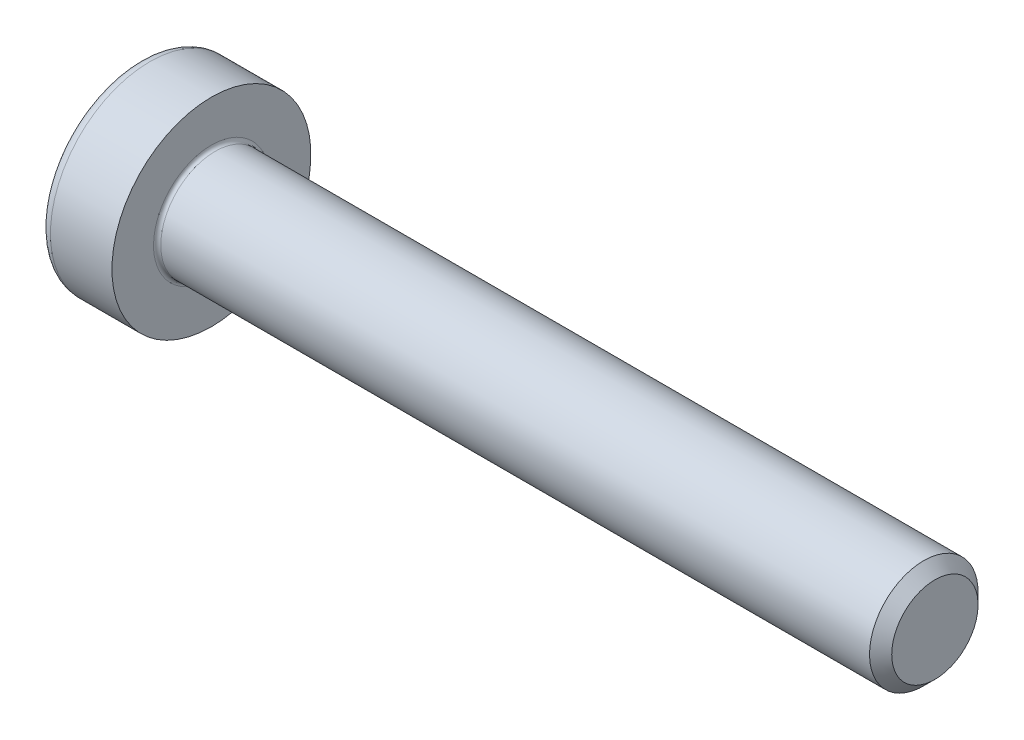
ISO-10303-21;
HEADER;
FILE_DESCRIPTION(('STEP AP214'),'2;1');
FILE_NAME('part.step','',(''),(''),'','','');
FILE_SCHEMA(('AUTOMOTIVE_DESIGN { 1 0 10303 214 1 1 1 1 }'));
ENDSEC;
DATA;
#1=APPLICATION_CONTEXT('core data for automotive mechanical design processes');
#2=APPLICATION_PROTOCOL_DEFINITION('international standard','automotive_design',2000,#1);
#3=PRODUCT_CONTEXT('',#1,'mechanical');
#4=PRODUCT('Part','Part','',(#3));
#5=PRODUCT_RELATED_PRODUCT_CATEGORY('part','',(#4));
#6=PRODUCT_DEFINITION_FORMATION('','',#4);
#7=PRODUCT_DEFINITION_CONTEXT('part definition',#1,'design');
#8=PRODUCT_DEFINITION('design','',#6,#7);
#9=PRODUCT_DEFINITION_SHAPE('','',#8);
#10=(LENGTH_UNIT() NAMED_UNIT(*) SI_UNIT(.MILLI.,.METRE.));
#11=(NAMED_UNIT(*) PLANE_ANGLE_UNIT() SI_UNIT($,.RADIAN.));
#12=(NAMED_UNIT(*) SI_UNIT($,.STERADIAN.) SOLID_ANGLE_UNIT());
#13=UNCERTAINTY_MEASURE_WITH_UNIT(LENGTH_MEASURE(1.E-05),#10,'distance_accuracy_value','');
#14=(GEOMETRIC_REPRESENTATION_CONTEXT(3) GLOBAL_UNCERTAINTY_ASSIGNED_CONTEXT((#13)) GLOBAL_UNIT_ASSIGNED_CONTEXT((#10,
#11,#12)) REPRESENTATION_CONTEXT('',''));
#15=CARTESIAN_POINT('',(0.,0.,0.));
#16=DIRECTION('',(0.,0.,1.));
#17=DIRECTION('',(1.,0.,0.));
#18=AXIS2_PLACEMENT_3D('',#15,#16,#17);
#19=CARTESIAN_POINT('',(-0.503999999864391,0.,0.));
#20=DIRECTION('',(-1.,0.,0.));
#21=DIRECTION('',(0.,0.,1.));
#22=AXIS2_PLACEMENT_3D('',#19,#20,#21);
#23=CONICAL_SURFACE('',#22,1.1616287414995,1.04719755106306);
#24=CARTESIAN_POINT('',(0.166666666729043,0.,-2.55795384873636E-10));
#25=VERTEX_POINT('',#24);
#26=VERTEX_LOOP('',#25);
#27=FACE_BOUND('',#26,.T.);
#28=CARTESIAN_POINT('',(-0.499999999935222,1.00000000000491,-0.577350269177087));
#29=CARTESIAN_POINT('',(-0.485347772489934,0.956056056225039,-0.602721316953868));
#30=CARTESIAN_POINT('',(-0.472022338470447,0.911732788945331,-0.628311367251723));
#31=CARTESIAN_POINT('',(-0.448763193610896,0.82231882665936,-0.67993454244871));
#32=CARTESIAN_POINT('',(-0.438837710076516,0.777226543457182,-0.705968584293173));
#33=CARTESIAN_POINT('',(-0.423387979375422,0.687600783115176,-0.757714041152466));
#34=CARTESIAN_POINT('',(-0.417760893698934,0.643081092184438,-0.783417496695743));
#35=CARTESIAN_POINT('',(-0.41104458396388,0.553832339757466,-0.834945287934423));
#36=CARTESIAN_POINT('',(-0.409949796885829,0.509103602433593,-0.860769436468825));
#37=CARTESIAN_POINT('',(-0.41223314497789,0.425532755130289,-0.909019087655762));
#38=CARTESIAN_POINT('',(-0.415050642509833,0.386678104664362,-0.931451830561545));
#39=CARTESIAN_POINT('',(-0.423978650263971,0.309221929106313,-0.97617117437039));
#40=CARTESIAN_POINT('',(-0.430092207291208,0.270620671714464,-0.99845762071663));
#41=CARTESIAN_POINT('',(-0.445374916580759,0.193004929129963,-1.04326909059114));
#42=CARTESIAN_POINT('',(-0.454608821023536,0.154000262301474,-1.06578844548422));
#43=CARTESIAN_POINT('',(-0.475565880340147,0.0765725149931354,-1.11049137623544));
#44=CARTESIAN_POINT('',(-0.487284114299871,0.0381484433395347,-1.13267552434801));
#45=CARTESIAN_POINT('',(-0.499999999927232,-1.64991277628039E-12,-1.1547005383802));
#46=B_SPLINE_CURVE_WITH_KNOTS('',3,(#28,#29,#30,#31,#32,#33,#34,#35,#36,#37,#38,#39,#40,#41,#42,
#43,#44,#45),.UNSPECIFIED.,.F.,.F.,(4,2,2,2,2,2,2,2,4),(0.,0.158508005788835,0.317396908534535,
0.472353803104991,0.627120444484892,0.761853891348244,0.896712096925861,1.03456081127119,
1.1721389867824),.UNSPECIFIED.);
#47=CARTESIAN_POINT('',(-0.499999999930649,1.00000000000519,-0.577350269194378));
#48=VERTEX_POINT('',#47);
#49=CARTESIAN_POINT('',(-0.499999999988176,-3.42089561929613E-13,-1.1547005384041));
#50=VERTEX_POINT('',#49);
#51=EDGE_CURVE('E59',#48,#50,#46,.T.);
#52=ORIENTED_EDGE('',*,*,#51,.T.);
#53=CARTESIAN_POINT('',(-0.499999999927126,1.33568071440912E-12,-1.15470053838002));
#54=CARTESIAN_POINT('',(-0.4853477724855,-0.0439439437814064,-1.1293294906078));
#55=CARTESIAN_POINT('',(-0.472022338467729,-0.0882672110619572,-1.10373944031201));
#56=CARTESIAN_POINT('',(-0.448763193609842,-0.177681173347852,-1.05211626511694));
#57=CARTESIAN_POINT('',(-0.438837710075409,-0.222773456549108,-1.02608222327232));
#58=CARTESIAN_POINT('',(-0.42338797937458,-0.312399216889828,-0.974336766413279));
#59=CARTESIAN_POINT('',(-0.417760893698407,-0.356918907820192,-0.948633310870395));
#60=CARTESIAN_POINT('',(-0.411044583963776,-0.446167660246257,-0.897105519632368));
#61=CARTESIAN_POINT('',(-0.409949796885831,-0.490896397569596,-0.871281371098226));
#62=CARTESIAN_POINT('',(-0.41223314497805,-0.574467244872945,-0.823031719911232));
#63=CARTESIAN_POINT('',(-0.415050642510144,-0.613321895339444,-0.80059897700513));
#64=CARTESIAN_POINT('',(-0.423978650264666,-0.690778070898627,-0.755879633195637));
#65=CARTESIAN_POINT('',(-0.430092207292135,-0.729379328291038,-0.73359318684907));
#66=CARTESIAN_POINT('',(-0.445374916582215,-0.806995070876625,-0.688781716973929));
#67=CARTESIAN_POINT('',(-0.454608821025286,-0.845999737705639,-0.666262362080546));
#68=CARTESIAN_POINT('',(-0.47556588034252,-0.923427485014991,-0.621559431328746));
#69=CARTESIAN_POINT('',(-0.487284114302569,-0.96185155666908,-0.599375283215896));
#70=CARTESIAN_POINT('',(-0.499999999930263,-1.00000000001075,-0.57735026918342));
#71=B_SPLINE_CURVE_WITH_KNOTS('',3,(#53,#54,#55,#56,#57,#58,#59,#60,#61,#62,#63,#64,#65,#66,#67,
#68,#69,#70),.UNSPECIFIED.,.F.,.F.,(4,2,2,2,2,2,2,2,4),(0.,0.158508005786671,0.317396908530352,
0.472353803099115,0.627120444477262,0.761853891342593,0.896712096922235,1.03456081126952,
1.17213898678261),.UNSPECIFIED.);
#72=CARTESIAN_POINT('',(-0.499999999928679,-1.00000000000599,-0.577350269186164));
#73=VERTEX_POINT('',#72);
#74=EDGE_CURVE('E229',#50,#73,#71,.T.);
#75=ORIENTED_EDGE('',*,*,#74,.T.);
#76=CARTESIAN_POINT('',(-0.499999999936326,-0.999999999990861,-0.577350269202308));
#77=CARTESIAN_POINT('',(-0.485347772490685,-0.999999999996718,-0.526608173658066));
#78=CARTESIAN_POINT('',(-0.472022338471013,-0.99999999999912,-0.47542807306613));
#79=CARTESIAN_POINT('',(-0.448763193611243,-1.00000000000088,-0.372181722674816));
#80=CARTESIAN_POINT('',(-0.43883771007683,-1.00000000000023,-0.320113638984764));
#81=CARTESIAN_POINT('',(-0.423387979375641,-0.999999999999772,-0.216622725265286));
#82=CARTESIAN_POINT('',(-0.417760893699089,-0.999999999999939,-0.16521581417893));
#83=CARTESIAN_POINT('',(-0.411044583963929,-1.00000000000006,-0.0621602317016219));
#84=CARTESIAN_POINT('',(-0.409949796885834,-1.00000000000002,-0.0105119346326718));
#85=CARTESIAN_POINT('',(-0.412233144977849,-0.999999999999987,0.0859873677423551));
#86=CARTESIAN_POINT('',(-0.415050642509862,-0.999999999999997,0.130852853554934));
#87=CARTESIAN_POINT('',(-0.423978650264289,-1.,0.220291541174657));
#88=CARTESIAN_POINT('',(-0.430092207291745,-1.,0.264864433868154));
#89=CARTESIAN_POINT('',(-0.445374916581862,-0.999999999999999,0.354487373619237));
#90=CARTESIAN_POINT('',(-0.454608821024991,-1.,0.39952608340644));
#91=CARTESIAN_POINT('',(-0.475565880342394,-1.,0.48893194491092));
#92=CARTESIAN_POINT('',(-0.487284114302557,-1.,0.533300241137063));
#93=CARTESIAN_POINT('',(-0.499999999930384,-1.,0.577350269202451));
#94=B_SPLINE_CURVE_WITH_KNOTS('',3,(#76,#77,#78,#79,#80,#81,#82,#83,#84,#85,#86,#87,#88,#89,#90,
#91,#92,#93),.UNSPECIFIED.,.F.,.F.,(4,2,2,2,2,2,2,2,4),(0.,0.158508005789129,0.317396908535113,
0.472353803105792,0.627120444485919,0.761853891352357,0.896712096933068,1.03456081128166,
1.17213898679613),.UNSPECIFIED.);
#95=CARTESIAN_POINT('',(-0.499999999930741,-1.00000000000599,0.577350269193305));
#96=VERTEX_POINT('',#95);
#97=EDGE_CURVE('E123',#73,#96,#94,.T.);
#98=ORIENTED_EDGE('',*,*,#97,.T.);
#99=CARTESIAN_POINT('',(-0.499999999936118,-1.00000000000613,0.577350269175695));
#100=CARTESIAN_POINT('',(-0.485347772490544,-0.956056056226443,0.60272131695281));
#101=CARTESIAN_POINT('',(-0.472022338470907,-0.911732788946778,0.628311367250821));
#102=CARTESIAN_POINT('',(-0.448763193611179,-0.822318826660767,0.679934542447963));
#103=CARTESIAN_POINT('',(-0.438837710076773,-0.777226543458507,0.705968584292426));
#104=CARTESIAN_POINT('',(-0.423387979375601,-0.687600783116374,0.757714041151757));
#105=CARTESIAN_POINT('',(-0.417760893699061,-0.643081092185593,0.783417496695072));
#106=CARTESIAN_POINT('',(-0.41104458396392,-0.553832339758519,0.834945287933819));
#107=CARTESIAN_POINT('',(-0.409949796885833,-0.50910360243459,0.86076943646825));
#108=CARTESIAN_POINT('',(-0.412233144977839,-0.425532755131153,0.909019087655262));
#109=CARTESIAN_POINT('',(-0.415050642509762,-0.386678104665149,0.931451830561089));
#110=CARTESIAN_POINT('',(-0.423978650263877,-0.309221929106949,0.976171174370023));
#111=CARTESIAN_POINT('',(-0.43009220729111,-0.270620671715024,0.998457620716306));
#112=CARTESIAN_POINT('',(-0.445374916580667,-0.193004929130366,1.04326909059091));
#113=CARTESIAN_POINT('',(-0.454608821023455,-0.154000262301795,1.06578844548404));
#114=CARTESIAN_POINT('',(-0.475565880340099,-0.0765725149932948,1.11049137623535));
#115=CARTESIAN_POINT('',(-0.487284114299844,-0.0381484433396136,1.13267552434796));
#116=CARTESIAN_POINT('',(-0.499999999927232,1.65021626823968E-12,1.1547005383802));
#117=B_SPLINE_CURVE_WITH_KNOTS('',3,(#99,#100,#101,#102,#103,#104,#105,#106,#107,#108,#109,#110,
#111,#112,#113,#114,#115,#116),.UNSPECIFIED.,.F.,.F.,(4,2,2,2,2,2,2,2,4),(0.,0.158508005789065,
0.317396908534985,0.47235380310563,0.627120444485725,0.761853891349336,0.896712096927209,
1.03456081127282,1.17213898678432),.UNSPECIFIED.);
#118=CARTESIAN_POINT('',(-0.499999999988176,3.42418720585571E-13,1.1547005384041));
#119=VERTEX_POINT('',#118);
#120=EDGE_CURVE('E129',#96,#119,#117,.T.);
#121=ORIENTED_EDGE('',*,*,#120,.T.);
#122=CARTESIAN_POINT('',(-0.499999999927126,-1.33551672094008E-12,1.15470053838002));
#123=CARTESIAN_POINT('',(-0.4853477724855,0.0439439437814068,1.1293294906078));
#124=CARTESIAN_POINT('',(-0.472022338467729,0.0882672110619575,1.10373944031201));
#125=CARTESIAN_POINT('',(-0.448763193609842,0.177681173347853,1.05211626511694));
#126=CARTESIAN_POINT('',(-0.438837710075408,0.222773456549108,1.02608222327232));
#127=CARTESIAN_POINT('',(-0.423387979374579,0.312399216889829,0.974336766413278));
#128=CARTESIAN_POINT('',(-0.417760893698406,0.356918907820192,0.948633310870394));
#129=CARTESIAN_POINT('',(-0.411044583963776,0.446167660246258,0.897105519632367));
#130=CARTESIAN_POINT('',(-0.409949796885831,0.490896397569596,0.871281371098225));
#131=CARTESIAN_POINT('',(-0.412233144978051,0.574467244872975,0.823031719911214));
#132=CARTESIAN_POINT('',(-0.415050642510149,0.613321895339505,0.800598977005094));
#133=CARTESIAN_POINT('',(-0.423978650264682,0.690778070898748,0.755879633195566));
#134=CARTESIAN_POINT('',(-0.43009220729216,0.729379328291189,0.733593186848982));
#135=CARTESIAN_POINT('',(-0.445374916582261,0.806995070876836,0.688781716973806));
#136=CARTESIAN_POINT('',(-0.454608821025345,0.845999737705881,0.666262362080405));
#137=CARTESIAN_POINT('',(-0.475565880342607,0.923427485015293,0.62155943132857));
#138=CARTESIAN_POINT('',(-0.487284114302673,0.961851556669411,0.599375283215703));
#139=CARTESIAN_POINT('',(-0.499999999930383,1.00000000001111,0.57735026918321));
#140=B_SPLINE_CURVE_WITH_KNOTS('',3,(#122,#123,#124,#125,#126,#127,#128,#129,#130,#131,#132,
#133,#134,#135,#136,#137,#138,#139),.UNSPECIFIED.,.F.,.F.,(4,2,2,2,2,2,2,2,4),(0.,
0.158508005786671,0.317396908530353,0.472353803099116,0.627120444477262,0.761853891342699,
0.896712096922446,1.03456081126984,1.17213898678305),.UNSPECIFIED.);
#141=CARTESIAN_POINT('',(-0.49999999993074,1.00000000000618,0.577350269192973));
#142=VERTEX_POINT('',#141);
#143=EDGE_CURVE('E135',#119,#142,#140,.T.);
#144=ORIENTED_EDGE('',*,*,#143,.T.);
#145=CARTESIAN_POINT('',(-0.499999999936117,0.999999999990998,0.577350269201893));
#146=CARTESIAN_POINT('',(-0.485347772490542,0.999999999996767,0.526608173657651));
#147=CARTESIAN_POINT('',(-0.472022338470903,0.999999999999133,0.475428073065723));
#148=CARTESIAN_POINT('',(-0.448763193611175,1.00000000000087,0.372181722674434));
#149=CARTESIAN_POINT('',(-0.438837710076768,1.00000000000023,0.320113638984397));
#150=CARTESIAN_POINT('',(-0.423387979375597,0.999999999999775,0.216622725264949));
#151=CARTESIAN_POINT('',(-0.417760893699058,0.99999999999994,0.165215814178607));
#152=CARTESIAN_POINT('',(-0.411044583963919,1.00000000000006,0.0621602317013294));
#153=CARTESIAN_POINT('',(-0.409949796885833,1.00000000000001,0.0105119346323955));
#154=CARTESIAN_POINT('',(-0.412233144977866,0.999999999999986,-0.08598736774282));
#155=CARTESIAN_POINT('',(-0.415050642509906,0.999999999999995,-0.130852853555603));
#156=CARTESIAN_POINT('',(-0.423978650264417,1.,-0.220291541175731));
#157=CARTESIAN_POINT('',(-0.430092207291929,1.,-0.264864433869428));
#158=CARTESIAN_POINT('',(-0.445374916582181,0.999999999999998,-0.354487373620916));
#159=CARTESIAN_POINT('',(-0.45460882102539,0.999999999999998,-0.399526083408323));
#160=CARTESIAN_POINT('',(-0.475565880342969,0.999999999999999,-0.488931944913203));
#161=CARTESIAN_POINT('',(-0.487284114303228,0.999999999999999,-0.533300241139541));
#162=CARTESIAN_POINT('',(-0.499999999931155,0.999999999999998,-0.577350269205123));
#163=B_SPLINE_CURVE_WITH_KNOTS('',3,(#145,#146,#147,#148,#149,#150,#151,#152,#153,#154,#155,
#156,#157,#158,#159,#160,#161,#162),.UNSPECIFIED.,.F.,.F.,(4,2,2,2,2,2,2,2,4),(0.,
0.158508005789078,0.317396908535014,0.472353803105645,0.627120444485724,0.761853891352777,
0.896712096934106,1.03456081128335,1.17213898679845),.UNSPECIFIED.);
#164=EDGE_CURVE('E141',#142,#48,#163,.T.);
#165=ORIENTED_EDGE('',*,*,#164,.T.);
#166=EDGE_LOOP('',(#52,#75,#98,#121,#144,#165));
#167=FACE_BOUND('',#166,.T.);
#168=ADVANCED_FACE('F17',(#27,#167),#23,.F.);
#169=CARTESIAN_POINT('',(-2.,0.,-1.15470053837925));
#170=DIRECTION('',(0.,-0.5,-0.866025403784438));
#171=DIRECTION('',(0.,0.866025403784438,-0.5));
#172=AXIS2_PLACEMENT_3D('',#169,#170,#171);
#173=PLANE('',#172);
#174=DIRECTION('',(0.,0.866025403784438,-0.5));
#175=VECTOR('',#174,1.);
#176=CARTESIAN_POINT('',(-2.,-1.,-0.577350269189624));
#177=LINE('',#176,#175);
#178=CARTESIAN_POINT('',(-2.,-1.,-0.577350269189624));
#179=VERTEX_POINT('',#178);
#180=CARTESIAN_POINT('',(-2.,-6.2778370798231E-13,-1.15470053837955));
#181=VERTEX_POINT('',#180);
#182=EDGE_CURVE('E117',#179,#181,#177,.T.);
#183=ORIENTED_EDGE('',*,*,#182,.F.);
#184=DIRECTION('',(1.,0.,0.));
#185=VECTOR('',#184,1.);
#186=CARTESIAN_POINT('',(-2.,-1.,-0.577350269189624));
#187=LINE('',#186,#185);
#188=EDGE_CURVE('E114',#179,#73,#187,.T.);
#189=ORIENTED_EDGE('',*,*,#188,.T.);
#190=ORIENTED_EDGE('',*,*,#74,.F.);
#191=DIRECTION('',(1.,0.,0.));
#192=VECTOR('',#191,1.);
#193=CARTESIAN_POINT('',(-2.,-1.36999786515268E-12,-1.15470053838004));
#194=LINE('',#193,#192);
#195=EDGE_CURVE('E144',#50,#181,#194,.F.);
#196=ORIENTED_EDGE('',*,*,#195,.T.);
#197=EDGE_LOOP('',(#183,#189,#190,#196));
#198=FACE_BOUND('',#197,.T.);
#199=ADVANCED_FACE('F64',(#198),#173,.F.);
#200=CARTESIAN_POINT('',(-2.,0.999999999999999,-0.577350269189627));
#201=DIRECTION('',(0.,0.5,-0.866025403784439));
#202=DIRECTION('',(0.,0.866025403784439,0.5));
#203=AXIS2_PLACEMENT_3D('',#200,#201,#202);
#204=PLANE('',#203);
#205=DIRECTION('',(0.,0.866025403784439,0.499999999999999));
#206=VECTOR('',#205,1.);
#207=CARTESIAN_POINT('',(-2.,0.,-1.15470053837925));
#208=LINE('',#207,#206);
#209=CARTESIAN_POINT('',(-2.,0.999999999999999,-0.577350269191605));
#210=VERTEX_POINT('',#209);
#211=EDGE_CURVE('E151',#181,#210,#208,.T.);
#212=ORIENTED_EDGE('',*,*,#211,.F.);
#213=ORIENTED_EDGE('',*,*,#195,.F.);
#214=ORIENTED_EDGE('',*,*,#51,.F.);
#215=DIRECTION('',(1.,0.,0.));
#216=VECTOR('',#215,1.);
#217=CARTESIAN_POINT('',(-2.,0.999999999999998,-0.577350269192792));
#218=LINE('',#217,#216);
#219=EDGE_CURVE('E138',#48,#210,#218,.F.);
#220=ORIENTED_EDGE('',*,*,#219,.T.);
#221=EDGE_LOOP('',(#212,#213,#214,#220));
#222=FACE_BOUND('',#221,.T.);
#223=ADVANCED_FACE('F70',(#222),#204,.F.);
#224=CARTESIAN_POINT('',(-2.,1.,0.577350269189624));
#225=DIRECTION('',(0.,1.,0.));
#226=DIRECTION('',(0.,0.,1.));
#227=AXIS2_PLACEMENT_3D('',#224,#225,#226);
#228=PLANE('',#227);
#229=DIRECTION('',(0.,0.,1.));
#230=VECTOR('',#229,1.);
#231=CARTESIAN_POINT('',(-2.,0.999999999999999,0.));
#232=LINE('',#231,#230);
#233=CARTESIAN_POINT('',(-2.,1.00000000000086,0.577350269189129));
#234=VERTEX_POINT('',#233);
#235=EDGE_CURVE('E167',#210,#234,#232,.T.);
#236=ORIENTED_EDGE('',*,*,#235,.F.);
#237=ORIENTED_EDGE('',*,*,#219,.F.);
#238=ORIENTED_EDGE('',*,*,#164,.F.);
#239=DIRECTION('',(1.,0.,0.));
#240=VECTOR('',#239,1.);
#241=CARTESIAN_POINT('',(-2.,1.00000000000137,0.577350269188831));
#242=LINE('',#241,#240);
#243=EDGE_CURVE('E132',#142,#234,#242,.F.);
#244=ORIENTED_EDGE('',*,*,#243,.T.);
#245=EDGE_LOOP('',(#236,#237,#238,#244));
#246=FACE_BOUND('',#245,.T.);
#247=ADVANCED_FACE('F211',(#246),#228,.F.);
#248=CARTESIAN_POINT('',(-2.,0.,1.15470053837925));
#249=DIRECTION('',(0.,0.500000000000001,0.866025403784438));
#250=DIRECTION('',(0.,-0.866025403784438,0.500000000000001));
#251=AXIS2_PLACEMENT_3D('',#248,#249,#250);
#252=PLANE('',#251);
#253=DIRECTION('',(0.,-0.866025403784438,0.500000000000001));
#254=VECTOR('',#253,1.);
#255=CARTESIAN_POINT('',(-2.,0.999999999999999,0.577350269189624));
#256=LINE('',#255,#254);
#257=CARTESIAN_POINT('',(-2.,8.56236624270635E-13,1.15470053837975));
#258=VERTEX_POINT('',#257);
#259=EDGE_CURVE('E162',#234,#258,#256,.T.);
#260=ORIENTED_EDGE('',*,*,#259,.F.);
#261=ORIENTED_EDGE('',*,*,#243,.F.);
#262=ORIENTED_EDGE('',*,*,#143,.F.);
#263=DIRECTION('',(1.,0.,0.));
#264=VECTOR('',#263,1.);
#265=CARTESIAN_POINT('',(-2.,1.36999786515268E-12,1.15470053838004));
#266=LINE('',#265,#264);
#267=EDGE_CURVE('E126',#119,#258,#266,.F.);
#268=ORIENTED_EDGE('',*,*,#267,.T.);
#269=EDGE_LOOP('',(#260,#261,#262,#268));
#270=FACE_BOUND('',#269,.T.);
#271=ADVANCED_FACE('F206',(#270),#252,.F.);
#272=CARTESIAN_POINT('',(-2.,-1.,0.577350269189626));
#273=DIRECTION('',(0.,-0.5,0.866025403784439));
#274=DIRECTION('',(0.,-0.866025403784439,-0.5));
#275=AXIS2_PLACEMENT_3D('',#272,#273,#274);
#276=PLANE('',#275);
#277=DIRECTION('',(0.,-0.866025403784439,-0.499999999999999));
#278=VECTOR('',#277,1.);
#279=CARTESIAN_POINT('',(-2.,0.,1.15470053837925));
#280=LINE('',#279,#278);
#281=CARTESIAN_POINT('',(-2.,-1.,0.577350269190615));
#282=VERTEX_POINT('',#281);
#283=EDGE_CURVE('E157',#258,#282,#280,.T.);
#284=ORIENTED_EDGE('',*,*,#283,.F.);
#285=ORIENTED_EDGE('',*,*,#267,.F.);
#286=ORIENTED_EDGE('',*,*,#120,.F.);
#287=DIRECTION('',(1.,0.,0.));
#288=VECTOR('',#287,1.);
#289=CARTESIAN_POINT('',(-2.,-1.,0.577350269191208));
#290=LINE('',#289,#288);
#291=EDGE_CURVE('E118',#96,#282,#290,.F.);
#292=ORIENTED_EDGE('',*,*,#291,.T.);
#293=EDGE_LOOP('',(#284,#285,#286,#292));
#294=FACE_BOUND('',#293,.T.);
#295=ADVANCED_FACE('F201',(#294),#276,.F.);
#296=CARTESIAN_POINT('',(-2.,-1.,-0.577350269189625));
#297=DIRECTION('',(0.,-1.,0.));
#298=DIRECTION('',(1.,0.,0.));
#299=AXIS2_PLACEMENT_3D('',#296,#297,#298);
#300=PLANE('',#299);
#301=DIRECTION('',(0.,0.,1.));
#302=VECTOR('',#301,1.);
#303=CARTESIAN_POINT('',(-2.,-1.,0.));
#304=LINE('',#303,#302);
#305=EDGE_CURVE('E154',#282,#179,#304,.F.);
#306=ORIENTED_EDGE('',*,*,#305,.F.);
#307=ORIENTED_EDGE('',*,*,#291,.F.);
#308=ORIENTED_EDGE('',*,*,#97,.F.);
#309=ORIENTED_EDGE('',*,*,#188,.F.);
#310=EDGE_LOOP('',(#306,#307,#308,#309));
#311=FACE_BOUND('',#310,.T.);
#312=ADVANCED_FACE('F197',(#311),#300,.F.);
#313=CARTESIAN_POINT('',(-2.,1.95235026918963,0.));
#314=DIRECTION('',(-1.,0.,0.));
#315=DIRECTION('',(0.,-1.,0.));
#316=AXIS2_PLACEMENT_3D('',#313,#314,#315);
#317=PLANE('',#316);
#318=CARTESIAN_POINT('',(-2.,0.,0.));
#319=DIRECTION('',(1.,0.,0.));
#320=DIRECTION('',(0.,1.,0.));
#321=AXIS2_PLACEMENT_3D('',#318,#319,#320);
#322=CIRCLE('',#321,2.45);
#323=CARTESIAN_POINT('',(-2.,2.45,0.));
#324=VERTEX_POINT('',#323);
#325=EDGE_CURVE('E113',#324,#324,#322,.T.);
#326=ORIENTED_EDGE('',*,*,#325,.F.);
#327=EDGE_LOOP('',(#326));
#328=FACE_BOUND('',#327,.T.);
#329=ORIENTED_EDGE('',*,*,#283,.T.);
#330=ORIENTED_EDGE('',*,*,#305,.T.);
#331=ORIENTED_EDGE('',*,*,#182,.T.);
#332=ORIENTED_EDGE('',*,*,#211,.T.);
#333=ORIENTED_EDGE('',*,*,#235,.T.);
#334=ORIENTED_EDGE('',*,*,#259,.T.);
#335=EDGE_LOOP('',(#329,#330,#331,#332,#333,#334));
#336=FACE_BOUND('',#335,.T.);
#337=ADVANCED_FACE('F200',(#328,#336),#317,.T.);
#338=CARTESIAN_POINT('',(-1.7,0.,0.));
#339=DIRECTION('',(1.,0.,0.));
#340=DIRECTION('',(0.,1.,0.));
#341=AXIS2_PLACEMENT_3D('',#338,#339,#340);
#342=TOROIDAL_SURFACE('',#341,2.45,0.300000000000001);
#343=CARTESIAN_POINT('',(-1.7,0.,0.));
#344=DIRECTION('',(1.,0.,0.));
#345=DIRECTION('',(0.,1.,0.));
#346=AXIS2_PLACEMENT_3D('',#343,#344,#345);
#347=CIRCLE('',#346,2.75);
#348=CARTESIAN_POINT('',(-1.7,2.75,0.));
#349=VERTEX_POINT('',#348);
#350=EDGE_CURVE('E105',#349,#349,#347,.T.);
#351=ORIENTED_EDGE('',*,*,#350,.F.);
#352=EDGE_LOOP('',(#351));
#353=FACE_BOUND('',#352,.T.);
#354=ORIENTED_EDGE('',*,*,#325,.T.);
#355=EDGE_LOOP('',(#354));
#356=FACE_BOUND('',#355,.T.);
#357=ADVANCED_FACE('F269',(#353,#356),#342,.T.);
#358=CARTESIAN_POINT('',(-0.999999999999996,0.,0.));
#359=DIRECTION('',(1.,0.,0.));
#360=DIRECTION('',(0.,1.,0.));
#361=AXIS2_PLACEMENT_3D('',#358,#359,#360);
#362=CYLINDRICAL_SURFACE('',#361,2.75);
#363=ORIENTED_EDGE('',*,*,#350,.T.);
#364=EDGE_LOOP('',(#363));
#365=FACE_BOUND('',#364,.T.);
#366=CARTESIAN_POINT('',(0.,0.,0.));
#367=DIRECTION('',(1.,0.,0.));
#368=DIRECTION('',(0.,1.,0.));
#369=AXIS2_PLACEMENT_3D('',#366,#367,#368);
#370=CIRCLE('',#369,2.75);
#371=CARTESIAN_POINT('',(0.,2.75,0.));
#372=VERTEX_POINT('',#371);
#373=EDGE_CURVE('E104',#372,#372,#370,.T.);
#374=ORIENTED_EDGE('',*,*,#373,.F.);
#375=EDGE_LOOP('',(#374));
#376=FACE_BOUND('',#375,.T.);
#377=ADVANCED_FACE('F94',(#365,#376),#362,.T.);
#378=CARTESIAN_POINT('',(0.,2.125,0.));
#379=DIRECTION('',(1.,0.,0.));
#380=DIRECTION('',(0.,1.,0.));
#381=AXIS2_PLACEMENT_3D('',#378,#379,#380);
#382=PLANE('',#381);
#383=ORIENTED_EDGE('',*,*,#373,.T.);
#384=EDGE_LOOP('',(#383));
#385=FACE_BOUND('',#384,.T.);
#386=CARTESIAN_POINT('',(0.,0.,-1.6));
#387=CARTESIAN_POINT('',(0.,-0.304449951016725,-1.6001009257119));
#388=CARTESIAN_POINT('',(0.,-0.588951535298995,-1.48766128169989));
#389=CARTESIAN_POINT('',(0.,-0.896214094659146,-1.36622613089104));
#390=CARTESIAN_POINT('',(0.,-1.13137084989847,-1.13137084989848));
#391=CARTESIAN_POINT('',(0.,-1.36508531011187,-0.897956014889474));
#392=CARTESIAN_POINT('',(0.,-1.48766128169989,-0.588951535299007));
#393=CARTESIAN_POINT('',(0.,-1.59980408211201,-0.306248267829627));
#394=CARTESIAN_POINT('',(0.,-1.6,0.));
#395=CARTESIAN_POINT('',(0.,-1.60019461578501,0.304212890729989));
#396=CARTESIAN_POINT('',(0.,-1.48766128169989,0.588951535298987));
#397=CARTESIAN_POINT('',(0.,-1.36622613089144,0.89621409465832));
#398=CARTESIAN_POINT('',(0.,-1.13137084989848,1.13137084989847));
#399=CARTESIAN_POINT('',(0.,-0.897956014890013,1.36508531011175));
#400=CARTESIAN_POINT('',(0.,-0.588951535299002,1.48766128169989));
#401=CARTESIAN_POINT('',(0.,-0.306010103754814,1.59989855709463));
#402=CARTESIAN_POINT('',(0.,0.,1.6));
#403=B_SPLINE_CURVE_WITH_KNOTS('',2,(#386,#387,#388,#389,#390,#391,#392,#393,#394,#395,#396,
#397,#398,#399,#400,#401,#402),.UNSPECIFIED.,.F.,.F.,(3,2,2,2,2,2,2,2,3),(0.,0.125,0.25,0.375,
0.5,0.625,0.75,0.875,1.),.UNSPECIFIED.);
#404=CARTESIAN_POINT('',(0.,0.,-1.6));
#405=VERTEX_POINT('',#404);
#406=CARTESIAN_POINT('',(0.,0.,1.6));
#407=VERTEX_POINT('',#406);
#408=EDGE_CURVE('E34',#405,#407,#403,.T.);
#409=ORIENTED_EDGE('',*,*,#408,.T.);
#410=CARTESIAN_POINT('',(0.,0.,1.6));
#411=CARTESIAN_POINT('',(0.,0.304449951016785,1.6001009257119));
#412=CARTESIAN_POINT('',(0.,0.588951535299,1.48766128169989));
#413=CARTESIAN_POINT('',(0.,0.89621409465884,1.36622613089113));
#414=CARTESIAN_POINT('',(0.,1.13137084989848,1.13137084989847));
#415=CARTESIAN_POINT('',(0.,1.36508499852708,0.897956326075019));
#416=CARTESIAN_POINT('',(0.,1.48766128169989,0.588951535298992));
#417=CARTESIAN_POINT('',(0.,1.59990576220706,0.305992374545344));
#418=CARTESIAN_POINT('',(0.,1.6,0.));
#419=CARTESIAN_POINT('',(0.,1.60009376834225,-0.30446805689882));
#420=CARTESIAN_POINT('',(0.,1.48766128169989,-0.588951535299003));
#421=CARTESIAN_POINT('',(0.,1.36622613380686,-0.896214091739088));
#422=CARTESIAN_POINT('',(0.,1.13137084989847,-1.13137084989848));
#423=CARTESIAN_POINT('',(0.,0.897956014889921,-1.36508531011191));
#424=CARTESIAN_POINT('',(0.,0.588951535298992,-1.48766128169989));
#425=CARTESIAN_POINT('',(0.,0.306010103754522,-1.59989855709463));
#426=CARTESIAN_POINT('',(0.,0.,-1.6));
#427=B_SPLINE_CURVE_WITH_KNOTS('',2,(#410,#411,#412,#413,#414,#415,#416,#417,#418,#419,#420,
#421,#422,#423,#424,#425,#426),.UNSPECIFIED.,.F.,.F.,(3,2,2,2,2,2,2,2,3),(0.,0.125,0.25,0.375,
0.5,0.625,0.75,0.875,1.),.UNSPECIFIED.);
#428=EDGE_CURVE('E101',#407,#405,#427,.T.);
#429=ORIENTED_EDGE('',*,*,#428,.T.);
#430=EDGE_LOOP('',(#409,#429));
#431=FACE_BOUND('',#430,.T.);
#432=ADVANCED_FACE('F89',(#385,#431),#382,.T.);
#433=CARTESIAN_POINT('',(20.,0.75,0.));
#434=DIRECTION('',(1.,0.,0.));
#435=DIRECTION('',(0.,1.,0.));
#436=AXIS2_PLACEMENT_3D('',#433,#434,#435);
#437=PLANE('',#436);
#438=CARTESIAN_POINT('',(20.0000000000955,0.,0.));
#439=DIRECTION('',(-1.,0.,0.));
#440=DIRECTION('',(0.,0.,1.));
#441=AXIS2_PLACEMENT_3D('',#438,#439,#440);
#442=CIRCLE('',#441,1.19327499987776);
#443=CARTESIAN_POINT('',(20.0000000000955,0.,1.19327499987776));
#444=VERTEX_POINT('',#443);
#445=EDGE_CURVE('E180',#444,#444,#442,.T.);
#446=ORIENTED_EDGE('',*,*,#445,.F.);
#447=EDGE_LOOP('',(#446));
#448=FACE_BOUND('',#447,.T.);
#449=ADVANCED_FACE('F86',(#448),#437,.T.);
#450=CARTESIAN_POINT('',(0.100000000000002,0.,0.));
#451=DIRECTION('',(1.,0.,0.));
#452=DIRECTION('',(0.,1.,0.));
#453=AXIS2_PLACEMENT_3D('',#450,#451,#452);
#454=TOROIDAL_SURFACE('',#453,1.6,0.1);
#455=ORIENTED_EDGE('',*,*,#408,.F.);
#456=ORIENTED_EDGE('',*,*,#428,.F.);
#457=EDGE_LOOP('',(#455,#456));
#458=FACE_BOUND('',#457,.T.);
#459=CARTESIAN_POINT('',(0.100000000000003,0.,0.));
#460=DIRECTION('',(1.,0.,0.));
#461=DIRECTION('',(0.,1.,0.));
#462=AXIS2_PLACEMENT_3D('',#459,#460,#461);
#463=CIRCLE('',#462,1.5);
#464=CARTESIAN_POINT('',(0.100000000000003,1.5,0.));
#465=VERTEX_POINT('',#464);
#466=EDGE_CURVE('E21',#465,#465,#463,.T.);
#467=ORIENTED_EDGE('',*,*,#466,.F.);
#468=EDGE_LOOP('',(#467));
#469=FACE_BOUND('',#468,.T.);
#470=ADVANCED_FACE('F19',(#458,#469),#454,.F.);
#471=CARTESIAN_POINT('',(19.6932750001224,0.,0.));
#472=DIRECTION('',(-1.,0.,0.));
#473=DIRECTION('',(0.,0.,1.));
#474=AXIS2_PLACEMENT_3D('',#471,#472,#473);
#475=CONICAL_SURFACE('',#474,1.49999999985084,0.785398163397448);
#476=CARTESIAN_POINT('',(19.693275,0.,0.));
#477=DIRECTION('',(1.,0.,0.));
#478=DIRECTION('',(0.,1.,0.));
#479=AXIS2_PLACEMENT_3D('',#476,#477,#478);
#480=CIRCLE('',#479,1.5);
#481=CARTESIAN_POINT('',(19.693275,1.5,0.));
#482=VERTEX_POINT('',#481);
#483=EDGE_CURVE('E11',#482,#482,#480,.F.);
#484=ORIENTED_EDGE('',*,*,#483,.F.);
#485=EDGE_LOOP('',(#484));
#486=FACE_BOUND('',#485,.T.);
#487=ORIENTED_EDGE('',*,*,#445,.T.);
#488=EDGE_LOOP('',(#487));
#489=FACE_BOUND('',#488,.T.);
#490=ADVANCED_FACE('F76',(#486,#489),#475,.T.);
#491=CARTESIAN_POINT('',(14.,0.,0.));
#492=DIRECTION('',(1.,0.,0.));
#493=DIRECTION('',(0.,1.,0.));
#494=AXIS2_PLACEMENT_3D('',#491,#492,#493);
#495=CYLINDRICAL_SURFACE('',#494,1.5);
#496=ORIENTED_EDGE('',*,*,#483,.T.);
#497=EDGE_LOOP('',(#496));
#498=FACE_BOUND('',#497,.T.);
#499=ORIENTED_EDGE('',*,*,#466,.T.);
#500=EDGE_LOOP('',(#499));
#501=FACE_BOUND('',#500,.T.);
#502=ADVANCED_FACE('F74',(#498,#501),#495,.T.);
#503=CLOSED_SHELL('',(#168,#199,#223,#247,#271,#295,#312,#337,#357,#377,#432,#449,#470,#490,#502));
#504=MANIFOLD_SOLID_BREP('B1',#503);
#505=ADVANCED_BREP_SHAPE_REPRESENTATION('',(#18,#504),#14);
#506=SHAPE_DEFINITION_REPRESENTATION(#9,#505);
ENDSEC;
END-ISO-10303-21;
